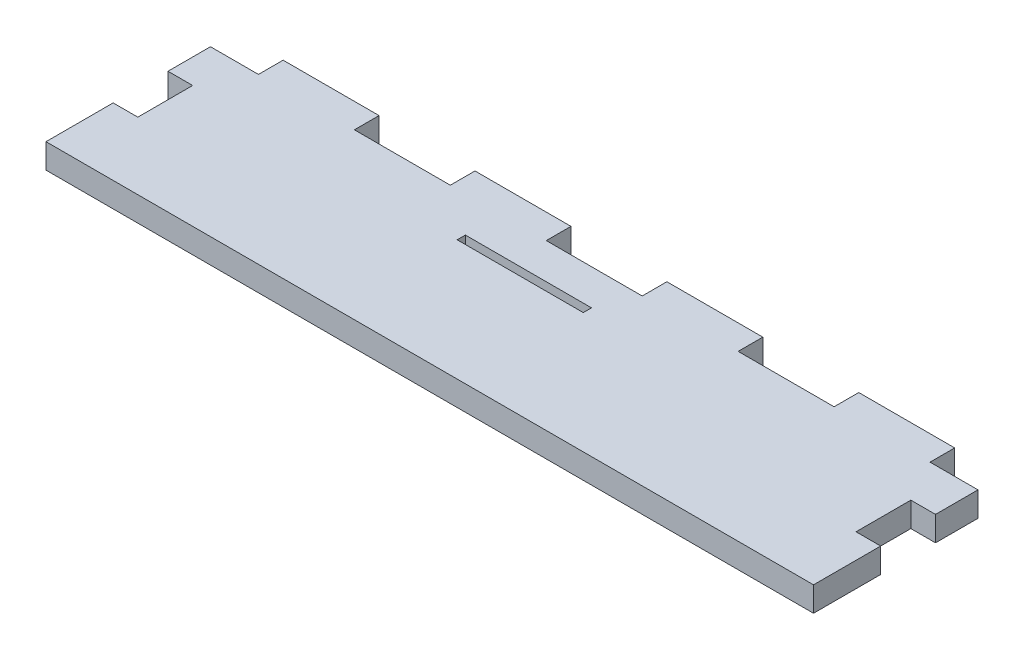
ISO-10303-21;
HEADER;
FILE_DESCRIPTION(('STEP AP214'),'2;1');
FILE_NAME('part.step','',(''),(''),'','','');
FILE_SCHEMA(('AUTOMOTIVE_DESIGN { 1 0 10303 214 1 1 1 1 }'));
ENDSEC;
DATA;
#1=APPLICATION_CONTEXT('core data for automotive mechanical design processes');
#2=APPLICATION_PROTOCOL_DEFINITION('international standard','automotive_design',2000,#1);
#3=PRODUCT_CONTEXT('',#1,'mechanical');
#4=PRODUCT('Part','Part','',(#3));
#5=PRODUCT_RELATED_PRODUCT_CATEGORY('part','',(#4));
#6=PRODUCT_DEFINITION_FORMATION('','',#4);
#7=PRODUCT_DEFINITION_CONTEXT('part definition',#1,'design');
#8=PRODUCT_DEFINITION('design','',#6,#7);
#9=PRODUCT_DEFINITION_SHAPE('','',#8);
#10=(LENGTH_UNIT() NAMED_UNIT(*) SI_UNIT(.MILLI.,.METRE.));
#11=(NAMED_UNIT(*) PLANE_ANGLE_UNIT() SI_UNIT($,.RADIAN.));
#12=(NAMED_UNIT(*) SI_UNIT($,.STERADIAN.) SOLID_ANGLE_UNIT());
#13=UNCERTAINTY_MEASURE_WITH_UNIT(LENGTH_MEASURE(1.E-05),#10,'distance_accuracy_value','');
#14=(GEOMETRIC_REPRESENTATION_CONTEXT(3) GLOBAL_UNCERTAINTY_ASSIGNED_CONTEXT((#13)) GLOBAL_UNIT_ASSIGNED_CONTEXT((#10,
#11,#12)) REPRESENTATION_CONTEXT('',''));
#15=CARTESIAN_POINT('',(0.,0.,0.));
#16=DIRECTION('',(0.,0.,1.));
#17=DIRECTION('',(1.,0.,0.));
#18=AXIS2_PLACEMENT_3D('',#15,#16,#17);
#19=CARTESIAN_POINT('',(140.,0.,349.144605516508));
#20=DIRECTION('',(-1.,0.,0.));
#21=DIRECTION('',(0.,0.,1.));
#22=AXIS2_PLACEMENT_3D('',#19,#20,#21);
#23=PLANE('',#22);
#24=DIRECTION('',(0.,0.,-1.));
#25=VECTOR('',#24,1.);
#26=CARTESIAN_POINT('',(140.,75.,349.144605516508));
#27=LINE('',#26,#25);
#28=CARTESIAN_POINT('',(140.,75.,69.));
#29=VERTEX_POINT('',#28);
#30=CARTESIAN_POINT('',(140.,75.,44.5));
#31=VERTEX_POINT('',#30);
#32=EDGE_CURVE('E449',#29,#31,#27,.T.);
#33=ORIENTED_EDGE('',*,*,#32,.F.);
#34=DIRECTION('',(0.,1.,0.));
#35=VECTOR('',#34,1.);
#36=CARTESIAN_POINT('',(140.,0.,69.));
#37=LINE('',#36,#35);
#38=CARTESIAN_POINT('',(140.,66.,69.));
#39=VERTEX_POINT('',#38);
#40=EDGE_CURVE('E424',#39,#29,#37,.T.);
#41=ORIENTED_EDGE('',*,*,#40,.F.);
#42=DIRECTION('',(0.,0.,-1.));
#43=VECTOR('',#42,1.);
#44=CARTESIAN_POINT('',(140.,66.,349.144605516508));
#45=LINE('',#44,#43);
#46=CARTESIAN_POINT('',(140.,66.,44.5));
#47=VERTEX_POINT('',#46);
#48=EDGE_CURVE('E445',#39,#47,#45,.T.);
#49=ORIENTED_EDGE('',*,*,#48,.T.);
#50=DIRECTION('',(0.,1.,0.));
#51=VECTOR('',#50,1.);
#52=CARTESIAN_POINT('',(140.,-95.,44.5));
#53=LINE('',#52,#51);
#54=EDGE_CURVE('E302',#47,#31,#53,.T.);
#55=ORIENTED_EDGE('',*,*,#54,.T.);
#56=EDGE_LOOP('',(#33,#41,#49,#55));
#57=FACE_BOUND('',#56,.T.);
#58=ADVANCED_FACE('F35',(#57),#23,.F.);
#59=CARTESIAN_POINT('',(-140.,0.,349.144605516508));
#60=DIRECTION('',(-1.,0.,0.));
#61=DIRECTION('',(0.,0.,1.));
#62=AXIS2_PLACEMENT_3D('',#59,#60,#61);
#63=PLANE('',#62);
#64=DIRECTION('',(0.,1.,0.));
#65=VECTOR('',#64,1.);
#66=CARTESIAN_POINT('',(-140.,-95.,24.5));
#67=LINE('',#66,#65);
#68=CARTESIAN_POINT('',(-140.,66.,24.5));
#69=VERTEX_POINT('',#68);
#70=CARTESIAN_POINT('',(-140.,75.,24.5));
#71=VERTEX_POINT('',#70);
#72=EDGE_CURVE('E287',#69,#71,#67,.T.);
#73=ORIENTED_EDGE('',*,*,#72,.T.);
#74=DIRECTION('',(0.,0.,-1.));
#75=VECTOR('',#74,1.);
#76=CARTESIAN_POINT('',(-140.,75.,349.144605516508));
#77=LINE('',#76,#75);
#78=CARTESIAN_POINT('',(-140.,75.,9.));
#79=VERTEX_POINT('',#78);
#80=EDGE_CURVE('E452',#71,#79,#77,.T.);
#81=ORIENTED_EDGE('',*,*,#80,.T.);
#82=DIRECTION('',(0.,-1.,0.));
#83=VECTOR('',#82,1.);
#84=CARTESIAN_POINT('',(-140.,0.,9.));
#85=LINE('',#84,#83);
#86=CARTESIAN_POINT('',(-140.,66.,9.));
#87=VERTEX_POINT('',#86);
#88=EDGE_CURVE('E432',#79,#87,#85,.T.);
#89=ORIENTED_EDGE('',*,*,#88,.T.);
#90=DIRECTION('',(0.,0.,-1.));
#91=VECTOR('',#90,1.);
#92=CARTESIAN_POINT('',(-140.,66.,349.144605516508));
#93=LINE('',#92,#91);
#94=EDGE_CURVE('E456',#69,#87,#93,.T.);
#95=ORIENTED_EDGE('',*,*,#94,.F.);
#96=EDGE_LOOP('',(#73,#81,#89,#95));
#97=FACE_BOUND('',#96,.T.);
#98=ADVANCED_FACE('F500',(#97),#63,.T.);
#99=CARTESIAN_POINT('',(0.,0.,9.));
#100=DIRECTION('',(0.,0.,-1.));
#101=DIRECTION('',(-1.,0.,0.));
#102=AXIS2_PLACEMENT_3D('',#99,#100,#101);
#103=PLANE('',#102);
#104=DIRECTION('',(0.,1.,0.));
#105=VECTOR('',#104,1.);
#106=CARTESIAN_POINT('',(87.5,0.,9.));
#107=LINE('',#106,#105);
#108=CARTESIAN_POINT('',(87.5,66.,9.));
#109=VERTEX_POINT('',#108);
#110=CARTESIAN_POINT('',(87.5,75.,9.));
#111=VERTEX_POINT('',#110);
#112=EDGE_CURVE('E312',#109,#111,#107,.T.);
#113=ORIENTED_EDGE('',*,*,#112,.F.);
#114=DIRECTION('',(-1.,0.,0.));
#115=VECTOR('',#114,1.);
#116=CARTESIAN_POINT('',(0.,66.,9.));
#117=LINE('',#116,#115);
#118=CARTESIAN_POINT('',(52.5,66.,9.));
#119=VERTEX_POINT('',#118);
#120=EDGE_CURVE('E433',#109,#119,#117,.T.);
#121=ORIENTED_EDGE('',*,*,#120,.T.);
#122=DIRECTION('',(0.,-1.,0.));
#123=VECTOR('',#122,1.);
#124=CARTESIAN_POINT('',(52.5,0.,9.));
#125=LINE('',#124,#123);
#126=CARTESIAN_POINT('',(52.5,75.,9.));
#127=VERTEX_POINT('',#126);
#128=EDGE_CURVE('E337',#127,#119,#125,.T.);
#129=ORIENTED_EDGE('',*,*,#128,.F.);
#130=DIRECTION('',(-1.,0.,0.));
#131=VECTOR('',#130,1.);
#132=CARTESIAN_POINT('',(0.,75.,9.));
#133=LINE('',#132,#131);
#134=EDGE_CURVE('E441',#111,#127,#133,.T.);
#135=ORIENTED_EDGE('',*,*,#134,.F.);
#136=EDGE_LOOP('',(#113,#121,#129,#135));
#137=FACE_BOUND('',#136,.T.);
#138=ADVANCED_FACE('F507',(#137),#103,.T.);
#139=DIRECTION('',(0.,1.,0.));
#140=VECTOR('',#139,1.);
#141=CARTESIAN_POINT('',(17.5,0.,9.));
#142=LINE('',#141,#140);
#143=CARTESIAN_POINT('',(17.5,66.,9.));
#144=VERTEX_POINT('',#143);
#145=CARTESIAN_POINT('',(17.5,75.,9.));
#146=VERTEX_POINT('',#145);
#147=EDGE_CURVE('E340',#144,#146,#142,.T.);
#148=ORIENTED_EDGE('',*,*,#147,.F.);
#149=CARTESIAN_POINT('',(-17.5,66.,9.));
#150=VERTEX_POINT('',#149);
#151=EDGE_CURVE('E585',#144,#150,#117,.T.);
#152=ORIENTED_EDGE('',*,*,#151,.T.);
#153=DIRECTION('',(0.,1.,0.));
#154=VECTOR('',#153,1.);
#155=CARTESIAN_POINT('',(-17.5,0.,9.));
#156=LINE('',#155,#154);
#157=CARTESIAN_POINT('',(-17.5,75.,9.));
#158=VERTEX_POINT('',#157);
#159=EDGE_CURVE('E365',#150,#158,#156,.T.);
#160=ORIENTED_EDGE('',*,*,#159,.T.);
#161=EDGE_CURVE('E601',#146,#158,#133,.T.);
#162=ORIENTED_EDGE('',*,*,#161,.F.);
#163=EDGE_LOOP('',(#148,#152,#160,#162));
#164=FACE_BOUND('',#163,.T.);
#165=ADVANCED_FACE('F614',(#164),#103,.T.);
#166=CARTESIAN_POINT('',(-52.5,66.,9.));
#167=VERTEX_POINT('',#166);
#168=CARTESIAN_POINT('',(-87.5,66.,9.));
#169=VERTEX_POINT('',#168);
#170=EDGE_CURVE('E566',#167,#169,#117,.T.);
#171=ORIENTED_EDGE('',*,*,#170,.T.);
#172=DIRECTION('',(0.,1.,0.));
#173=VECTOR('',#172,1.);
#174=CARTESIAN_POINT('',(-87.5,0.,9.));
#175=LINE('',#174,#173);
#176=CARTESIAN_POINT('',(-87.5,75.,9.));
#177=VERTEX_POINT('',#176);
#178=EDGE_CURVE('E393',#169,#177,#175,.T.);
#179=ORIENTED_EDGE('',*,*,#178,.T.);
#180=CARTESIAN_POINT('',(-52.5,75.,9.));
#181=VERTEX_POINT('',#180);
#182=EDGE_CURVE('E603',#181,#177,#133,.T.);
#183=ORIENTED_EDGE('',*,*,#182,.F.);
#184=DIRECTION('',(0.,-1.,0.));
#185=VECTOR('',#184,1.);
#186=CARTESIAN_POINT('',(-52.5,0.,9.));
#187=LINE('',#186,#185);
#188=EDGE_CURVE('E369',#181,#167,#187,.T.);
#189=ORIENTED_EDGE('',*,*,#188,.T.);
#190=EDGE_LOOP('',(#171,#179,#183,#189));
#191=FACE_BOUND('',#190,.T.);
#192=ADVANCED_FACE('F583',(#191),#103,.T.);
#193=DIRECTION('',(0.,-1.,0.));
#194=VECTOR('',#193,1.);
#195=CARTESIAN_POINT('',(122.5,-1.88892111828586E-13,9.));
#196=LINE('',#195,#194);
#197=CARTESIAN_POINT('',(122.5,75.,9.));
#198=VERTEX_POINT('',#197);
#199=CARTESIAN_POINT('',(122.5,66.,9.));
#200=VERTEX_POINT('',#199);
#201=EDGE_CURVE('E309',#198,#200,#196,.T.);
#202=ORIENTED_EDGE('',*,*,#201,.F.);
#203=CARTESIAN_POINT('',(140.,75.,9.));
#204=VERTEX_POINT('',#203);
#205=EDGE_CURVE('E437',#204,#198,#133,.T.);
#206=ORIENTED_EDGE('',*,*,#205,.F.);
#207=DIRECTION('',(0.,-1.,0.));
#208=VECTOR('',#207,1.);
#209=CARTESIAN_POINT('',(140.,0.,9.));
#210=LINE('',#209,#208);
#211=CARTESIAN_POINT('',(140.,66.,9.));
#212=VERTEX_POINT('',#211);
#213=EDGE_CURVE('E440',#204,#212,#210,.T.);
#214=ORIENTED_EDGE('',*,*,#213,.T.);
#215=EDGE_CURVE('E429',#212,#200,#117,.T.);
#216=ORIENTED_EDGE('',*,*,#215,.T.);
#217=EDGE_LOOP('',(#202,#206,#214,#216));
#218=FACE_BOUND('',#217,.T.);
#219=ADVANCED_FACE('F520',(#218),#103,.T.);
#220=DIRECTION('',(0.,-1.,0.));
#221=VECTOR('',#220,1.);
#222=CARTESIAN_POINT('',(-122.5,0.,9.));
#223=LINE('',#222,#221);
#224=CARTESIAN_POINT('',(-122.5,75.,9.));
#225=VERTEX_POINT('',#224);
#226=CARTESIAN_POINT('',(-122.5,66.,9.));
#227=VERTEX_POINT('',#226);
#228=EDGE_CURVE('E397',#225,#227,#223,.T.);
#229=ORIENTED_EDGE('',*,*,#228,.T.);
#230=EDGE_CURVE('E396',#227,#87,#117,.T.);
#231=ORIENTED_EDGE('',*,*,#230,.T.);
#232=ORIENTED_EDGE('',*,*,#88,.F.);
#233=EDGE_CURVE('E436',#225,#79,#133,.T.);
#234=ORIENTED_EDGE('',*,*,#233,.F.);
#235=EDGE_LOOP('',(#229,#231,#232,#234));
#236=FACE_BOUND('',#235,.T.);
#237=ADVANCED_FACE('F514',(#236),#103,.T.);
#238=CARTESIAN_POINT('',(140.,66.,24.5));
#239=VERTEX_POINT('',#238);
#240=EDGE_CURVE('E444',#239,#212,#45,.T.);
#241=ORIENTED_EDGE('',*,*,#240,.T.);
#242=ORIENTED_EDGE('',*,*,#213,.F.);
#243=CARTESIAN_POINT('',(140.,75.,24.5));
#244=VERTEX_POINT('',#243);
#245=EDGE_CURVE('E448',#244,#204,#27,.T.);
#246=ORIENTED_EDGE('',*,*,#245,.F.);
#247=DIRECTION('',(0.,1.,0.));
#248=VECTOR('',#247,1.);
#249=CARTESIAN_POINT('',(140.,-95.,24.5));
#250=LINE('',#249,#248);
#251=EDGE_CURVE('E305',#239,#244,#250,.T.);
#252=ORIENTED_EDGE('',*,*,#251,.F.);
#253=EDGE_LOOP('',(#241,#242,#246,#252));
#254=FACE_BOUND('',#253,.T.);
#255=ADVANCED_FACE('F503',(#254),#23,.F.);
#256=CARTESIAN_POINT('',(0.,75.,349.144605516508));
#257=DIRECTION('',(0.,1.,0.));
#258=DIRECTION('',(0.,0.,-1.));
#259=AXIS2_PLACEMENT_3D('',#256,#257,#258);
#260=PLANE('',#259);
#261=DIRECTION('',(0.,0.,1.));
#262=VECTOR('',#261,1.);
#263=CARTESIAN_POINT('',(-34.,75.,25.));
#264=LINE('',#263,#262);
#265=CARTESIAN_POINT('',(-34.,75.,22.));
#266=VERTEX_POINT('',#265);
#267=CARTESIAN_POINT('',(-34.,75.,25.));
#268=VERTEX_POINT('',#267);
#269=EDGE_CURVE('E50',#266,#268,#264,.T.);
#270=ORIENTED_EDGE('',*,*,#269,.F.);
#271=DIRECTION('',(-1.,0.,0.));
#272=VECTOR('',#271,1.);
#273=CARTESIAN_POINT('',(-34.,75.,22.));
#274=LINE('',#273,#272);
#275=CARTESIAN_POINT('',(12.,75.,22.));
#276=VERTEX_POINT('',#275);
#277=EDGE_CURVE('E263',#276,#266,#274,.T.);
#278=ORIENTED_EDGE('',*,*,#277,.F.);
#279=DIRECTION('',(0.,0.,-1.));
#280=VECTOR('',#279,1.);
#281=CARTESIAN_POINT('',(12.,75.,25.));
#282=LINE('',#281,#280);
#283=CARTESIAN_POINT('',(12.,75.,25.));
#284=VERTEX_POINT('',#283);
#285=EDGE_CURVE('E247',#284,#276,#282,.T.);
#286=ORIENTED_EDGE('',*,*,#285,.F.);
#287=DIRECTION('',(1.,0.,0.));
#288=VECTOR('',#287,1.);
#289=CARTESIAN_POINT('',(-34.,75.,25.));
#290=LINE('',#289,#288);
#291=EDGE_CURVE('E256',#268,#284,#290,.T.);
#292=ORIENTED_EDGE('',*,*,#291,.F.);
#293=EDGE_LOOP('',(#270,#278,#286,#292));
#294=FACE_BOUND('',#293,.T.);
#295=DIRECTION('',(1.,0.,0.));
#296=VECTOR('',#295,1.);
#297=CARTESIAN_POINT('',(-131.,75.,24.5));
#298=LINE('',#297,#296);
#299=CARTESIAN_POINT('',(-131.,75.,24.5));
#300=VERTEX_POINT('',#299);
#301=EDGE_CURVE('E280',#71,#300,#298,.T.);
#302=ORIENTED_EDGE('',*,*,#301,.T.);
#303=DIRECTION('',(0.,0.,1.));
#304=VECTOR('',#303,1.);
#305=CARTESIAN_POINT('',(-131.,75.,44.5));
#306=LINE('',#305,#304);
#307=CARTESIAN_POINT('',(-131.,75.,44.5));
#308=VERTEX_POINT('',#307);
#309=EDGE_CURVE('E273',#300,#308,#306,.T.);
#310=ORIENTED_EDGE('',*,*,#309,.T.);
#311=DIRECTION('',(-1.,0.,0.));
#312=VECTOR('',#311,1.);
#313=CARTESIAN_POINT('',(-131.,75.,44.5));
#314=LINE('',#313,#312);
#315=CARTESIAN_POINT('',(-140.,75.,44.5));
#316=VERTEX_POINT('',#315);
#317=EDGE_CURVE('E276',#308,#316,#314,.T.);
#318=ORIENTED_EDGE('',*,*,#317,.T.);
#319=CARTESIAN_POINT('',(-140.,75.,69.));
#320=VERTEX_POINT('',#319);
#321=EDGE_CURVE('E453',#320,#316,#77,.T.);
#322=ORIENTED_EDGE('',*,*,#321,.F.);
#323=DIRECTION('',(1.,0.,0.));
#324=VECTOR('',#323,1.);
#325=CARTESIAN_POINT('',(0.,75.,69.));
#326=LINE('',#325,#324);
#327=EDGE_CURVE('E421',#320,#29,#326,.T.);
#328=ORIENTED_EDGE('',*,*,#327,.T.);
#329=ORIENTED_EDGE('',*,*,#32,.T.);
#330=DIRECTION('',(-1.,0.,0.));
#331=VECTOR('',#330,1.);
#332=CARTESIAN_POINT('',(131.,75.,44.5));
#333=LINE('',#332,#331);
#334=CARTESIAN_POINT('',(131.,75.,44.5));
#335=VERTEX_POINT('',#334);
#336=EDGE_CURVE('E297',#31,#335,#333,.T.);
#337=ORIENTED_EDGE('',*,*,#336,.T.);
#338=DIRECTION('',(0.,0.,-1.));
#339=VECTOR('',#338,1.);
#340=CARTESIAN_POINT('',(131.,75.,44.5));
#341=LINE('',#340,#339);
#342=CARTESIAN_POINT('',(131.,75.,24.5));
#343=VERTEX_POINT('',#342);
#344=EDGE_CURVE('E270',#335,#343,#341,.T.);
#345=ORIENTED_EDGE('',*,*,#344,.T.);
#346=DIRECTION('',(1.,0.,0.));
#347=VECTOR('',#346,1.);
#348=CARTESIAN_POINT('',(131.,75.,24.5));
#349=LINE('',#348,#347);
#350=EDGE_CURVE('E295',#343,#244,#349,.T.);
#351=ORIENTED_EDGE('',*,*,#350,.T.);
#352=ORIENTED_EDGE('',*,*,#245,.T.);
#353=ORIENTED_EDGE('',*,*,#205,.T.);
#354=DIRECTION('',(0.,0.,-1.));
#355=VECTOR('',#354,1.);
#356=CARTESIAN_POINT('',(122.5,75.,45.1386219991853));
#357=LINE('',#356,#355);
#358=CARTESIAN_POINT('',(122.5,75.,0.));
#359=VERTEX_POINT('',#358);
#360=EDGE_CURVE('E332',#198,#359,#357,.T.);
#361=ORIENTED_EDGE('',*,*,#360,.T.);
#362=DIRECTION('',(1.,0.,0.));
#363=VECTOR('',#362,1.);
#364=CARTESIAN_POINT('',(0.,75.,0.));
#365=LINE('',#364,#363);
#366=CARTESIAN_POINT('',(87.5,75.,0.));
#367=VERTEX_POINT('',#366);
#368=EDGE_CURVE('E318',#367,#359,#365,.T.);
#369=ORIENTED_EDGE('',*,*,#368,.F.);
#370=DIRECTION('',(0.,0.,-1.));
#371=VECTOR('',#370,1.);
#372=CARTESIAN_POINT('',(87.5,75.,45.1386219991853));
#373=LINE('',#372,#371);
#374=EDGE_CURVE('E313',#111,#367,#373,.T.);
#375=ORIENTED_EDGE('',*,*,#374,.F.);
#376=ORIENTED_EDGE('',*,*,#134,.T.);
#377=DIRECTION('',(0.,0.,-1.));
#378=VECTOR('',#377,1.);
#379=CARTESIAN_POINT('',(52.5,75.,45.1386219991853));
#380=LINE('',#379,#378);
#381=CARTESIAN_POINT('',(52.5,75.,0.));
#382=VERTEX_POINT('',#381);
#383=EDGE_CURVE('E360',#127,#382,#380,.T.);
#384=ORIENTED_EDGE('',*,*,#383,.T.);
#385=DIRECTION('',(1.,0.,0.));
#386=VECTOR('',#385,1.);
#387=CARTESIAN_POINT('',(0.,75.,0.));
#388=LINE('',#387,#386);
#389=CARTESIAN_POINT('',(17.5,75.,0.));
#390=VERTEX_POINT('',#389);
#391=EDGE_CURVE('E346',#390,#382,#388,.T.);
#392=ORIENTED_EDGE('',*,*,#391,.F.);
#393=DIRECTION('',(0.,0.,-1.));
#394=VECTOR('',#393,1.);
#395=CARTESIAN_POINT('',(17.5,75.,45.1386219991853));
#396=LINE('',#395,#394);
#397=EDGE_CURVE('E341',#146,#390,#396,.T.);
#398=ORIENTED_EDGE('',*,*,#397,.F.);
#399=ORIENTED_EDGE('',*,*,#161,.T.);
#400=DIRECTION('',(0.,0.,-1.));
#401=VECTOR('',#400,1.);
#402=CARTESIAN_POINT('',(-17.5,75.,45.1386219991853));
#403=LINE('',#402,#401);
#404=CARTESIAN_POINT('',(-17.5,75.,0.));
#405=VERTEX_POINT('',#404);
#406=EDGE_CURVE('E388',#158,#405,#403,.T.);
#407=ORIENTED_EDGE('',*,*,#406,.T.);
#408=DIRECTION('',(1.,0.,0.));
#409=VECTOR('',#408,1.);
#410=CARTESIAN_POINT('',(0.,75.,0.));
#411=LINE('',#410,#409);
#412=CARTESIAN_POINT('',(-52.5,75.,0.));
#413=VERTEX_POINT('',#412);
#414=EDGE_CURVE('E344',#413,#405,#411,.T.);
#415=ORIENTED_EDGE('',*,*,#414,.F.);
#416=DIRECTION('',(0.,0.,-1.));
#417=VECTOR('',#416,1.);
#418=CARTESIAN_POINT('',(-52.5,75.,45.1386219991853));
#419=LINE('',#418,#417);
#420=EDGE_CURVE('E379',#181,#413,#419,.T.);
#421=ORIENTED_EDGE('',*,*,#420,.F.);
#422=ORIENTED_EDGE('',*,*,#182,.T.);
#423=DIRECTION('',(0.,0.,-1.));
#424=VECTOR('',#423,1.);
#425=CARTESIAN_POINT('',(-87.5,75.,45.1386219991853));
#426=LINE('',#425,#424);
#427=CARTESIAN_POINT('',(-87.5,75.,0.));
#428=VERTEX_POINT('',#427);
#429=EDGE_CURVE('E416',#177,#428,#426,.T.);
#430=ORIENTED_EDGE('',*,*,#429,.T.);
#431=DIRECTION('',(1.,0.,0.));
#432=VECTOR('',#431,1.);
#433=CARTESIAN_POINT('',(0.,75.,0.));
#434=LINE('',#433,#432);
#435=CARTESIAN_POINT('',(-122.5,75.,0.));
#436=VERTEX_POINT('',#435);
#437=EDGE_CURVE('E368',#436,#428,#434,.T.);
#438=ORIENTED_EDGE('',*,*,#437,.F.);
#439=DIRECTION('',(0.,0.,-1.));
#440=VECTOR('',#439,1.);
#441=CARTESIAN_POINT('',(-122.5,75.,45.1386219991853));
#442=LINE('',#441,#440);
#443=EDGE_CURVE('E407',#225,#436,#442,.T.);
#444=ORIENTED_EDGE('',*,*,#443,.F.);
#445=ORIENTED_EDGE('',*,*,#233,.T.);
#446=ORIENTED_EDGE('',*,*,#80,.F.);
#447=EDGE_LOOP('',(#302,#310,#318,#322,#328,#329,#337,#345,#351,#352,#353,#361,#369,#375,#376,
#384,#392,#398,#399,#407,#415,#421,#422,#430,#438,#444,#445,#446));
#448=FACE_BOUND('',#447,.T.);
#449=ADVANCED_FACE('F260',(#294,#448),#260,.T.);
#450=DIRECTION('',(0.,1.,0.));
#451=VECTOR('',#450,1.);
#452=CARTESIAN_POINT('',(-140.,-95.,44.5));
#453=LINE('',#452,#451);
#454=CARTESIAN_POINT('',(-140.,66.,44.5));
#455=VERTEX_POINT('',#454);
#456=EDGE_CURVE('E290',#455,#316,#453,.T.);
#457=ORIENTED_EDGE('',*,*,#456,.F.);
#458=CARTESIAN_POINT('',(-140.,66.,69.));
#459=VERTEX_POINT('',#458);
#460=EDGE_CURVE('E457',#459,#455,#93,.T.);
#461=ORIENTED_EDGE('',*,*,#460,.F.);
#462=DIRECTION('',(0.,1.,0.));
#463=VECTOR('',#462,1.);
#464=CARTESIAN_POINT('',(-140.,0.,69.));
#465=LINE('',#464,#463);
#466=EDGE_CURVE('E423',#459,#320,#465,.T.);
#467=ORIENTED_EDGE('',*,*,#466,.T.);
#468=ORIENTED_EDGE('',*,*,#321,.T.);
#469=EDGE_LOOP('',(#457,#461,#467,#468));
#470=FACE_BOUND('',#469,.T.);
#471=ADVANCED_FACE('F509',(#470),#63,.T.);
#472=CARTESIAN_POINT('',(0.,66.,349.144605516508));
#473=DIRECTION('',(0.,1.,0.));
#474=DIRECTION('',(0.,0.,-1.));
#475=AXIS2_PLACEMENT_3D('',#472,#473,#474);
#476=PLANE('',#475);
#477=DIRECTION('',(-1.,0.,0.));
#478=VECTOR('',#477,1.);
#479=CARTESIAN_POINT('',(0.,66.,22.));
#480=LINE('',#479,#478);
#481=CARTESIAN_POINT('',(12.,66.,22.));
#482=VERTEX_POINT('',#481);
#483=CARTESIAN_POINT('',(-34.,66.,22.));
#484=VERTEX_POINT('',#483);
#485=EDGE_CURVE('E43',#482,#484,#480,.T.);
#486=ORIENTED_EDGE('',*,*,#485,.T.);
#487=DIRECTION('',(0.,0.,1.));
#488=VECTOR('',#487,1.);
#489=CARTESIAN_POINT('',(-34.,66.,349.144605516508));
#490=LINE('',#489,#488);
#491=CARTESIAN_POINT('',(-34.,66.,25.));
#492=VERTEX_POINT('',#491);
#493=EDGE_CURVE('E11',#484,#492,#490,.T.);
#494=ORIENTED_EDGE('',*,*,#493,.T.);
#495=DIRECTION('',(1.,0.,0.));
#496=VECTOR('',#495,1.);
#497=CARTESIAN_POINT('',(0.,66.,25.));
#498=LINE('',#497,#496);
#499=CARTESIAN_POINT('',(12.,66.,25.));
#500=VERTEX_POINT('',#499);
#501=EDGE_CURVE('E477',#492,#500,#498,.T.);
#502=ORIENTED_EDGE('',*,*,#501,.T.);
#503=DIRECTION('',(0.,0.,-1.));
#504=VECTOR('',#503,1.);
#505=CARTESIAN_POINT('',(12.,66.,349.144605516508));
#506=LINE('',#505,#504);
#507=EDGE_CURVE('E250',#500,#482,#506,.T.);
#508=ORIENTED_EDGE('',*,*,#507,.T.);
#509=EDGE_LOOP('',(#486,#494,#502,#508));
#510=FACE_BOUND('',#509,.T.);
#511=ORIENTED_EDGE('',*,*,#94,.T.);
#512=ORIENTED_EDGE('',*,*,#230,.F.);
#513=DIRECTION('',(0.,0.,-1.));
#514=VECTOR('',#513,1.);
#515=CARTESIAN_POINT('',(-122.5,66.,45.1386219991853));
#516=LINE('',#515,#514);
#517=CARTESIAN_POINT('',(-122.5,66.,0.));
#518=VERTEX_POINT('',#517);
#519=EDGE_CURVE('E410',#227,#518,#516,.T.);
#520=ORIENTED_EDGE('',*,*,#519,.T.);
#521=DIRECTION('',(1.,0.,0.));
#522=VECTOR('',#521,1.);
#523=CARTESIAN_POINT('',(0.,66.,0.));
#524=LINE('',#523,#522);
#525=CARTESIAN_POINT('',(-87.5,66.,0.));
#526=VERTEX_POINT('',#525);
#527=EDGE_CURVE('E402',#518,#526,#524,.T.);
#528=ORIENTED_EDGE('',*,*,#527,.T.);
#529=DIRECTION('',(0.,0.,-1.));
#530=VECTOR('',#529,1.);
#531=CARTESIAN_POINT('',(-87.5,66.,45.1386219991853));
#532=LINE('',#531,#530);
#533=EDGE_CURVE('E413',#169,#526,#532,.T.);
#534=ORIENTED_EDGE('',*,*,#533,.F.);
#535=ORIENTED_EDGE('',*,*,#170,.F.);
#536=DIRECTION('',(0.,0.,-1.));
#537=VECTOR('',#536,1.);
#538=CARTESIAN_POINT('',(-52.5,66.,45.1386219991853));
#539=LINE('',#538,#537);
#540=CARTESIAN_POINT('',(-52.5,66.,0.));
#541=VERTEX_POINT('',#540);
#542=EDGE_CURVE('E382',#167,#541,#539,.T.);
#543=ORIENTED_EDGE('',*,*,#542,.T.);
#544=DIRECTION('',(1.,0.,0.));
#545=VECTOR('',#544,1.);
#546=CARTESIAN_POINT('',(0.,66.,0.));
#547=LINE('',#546,#545);
#548=CARTESIAN_POINT('',(-17.5,66.,0.));
#549=VERTEX_POINT('',#548);
#550=EDGE_CURVE('E374',#541,#549,#547,.T.);
#551=ORIENTED_EDGE('',*,*,#550,.T.);
#552=DIRECTION('',(0.,0.,-1.));
#553=VECTOR('',#552,1.);
#554=CARTESIAN_POINT('',(-17.5,66.,45.1386219991853));
#555=LINE('',#554,#553);
#556=EDGE_CURVE('E385',#150,#549,#555,.T.);
#557=ORIENTED_EDGE('',*,*,#556,.F.);
#558=ORIENTED_EDGE('',*,*,#151,.F.);
#559=DIRECTION('',(0.,0.,-1.));
#560=VECTOR('',#559,1.);
#561=CARTESIAN_POINT('',(17.5,66.,45.1386219991853));
#562=LINE('',#561,#560);
#563=CARTESIAN_POINT('',(17.5,66.,0.));
#564=VERTEX_POINT('',#563);
#565=EDGE_CURVE('E354',#144,#564,#562,.T.);
#566=ORIENTED_EDGE('',*,*,#565,.T.);
#567=DIRECTION('',(1.,0.,0.));
#568=VECTOR('',#567,1.);
#569=CARTESIAN_POINT('',(0.,66.,0.));
#570=LINE('',#569,#568);
#571=CARTESIAN_POINT('',(52.5,66.,0.));
#572=VERTEX_POINT('',#571);
#573=EDGE_CURVE('E351',#564,#572,#570,.T.);
#574=ORIENTED_EDGE('',*,*,#573,.T.);
#575=DIRECTION('',(0.,0.,-1.));
#576=VECTOR('',#575,1.);
#577=CARTESIAN_POINT('',(52.5,66.,45.1386219991853));
#578=LINE('',#577,#576);
#579=EDGE_CURVE('E357',#119,#572,#578,.T.);
#580=ORIENTED_EDGE('',*,*,#579,.F.);
#581=ORIENTED_EDGE('',*,*,#120,.F.);
#582=DIRECTION('',(0.,0.,-1.));
#583=VECTOR('',#582,1.);
#584=CARTESIAN_POINT('',(87.5,66.,45.1386219991853));
#585=LINE('',#584,#583);
#586=CARTESIAN_POINT('',(87.5,66.,0.));
#587=VERTEX_POINT('',#586);
#588=EDGE_CURVE('E326',#109,#587,#585,.T.);
#589=ORIENTED_EDGE('',*,*,#588,.T.);
#590=DIRECTION('',(1.,0.,0.));
#591=VECTOR('',#590,1.);
#592=CARTESIAN_POINT('',(0.,66.,0.));
#593=LINE('',#592,#591);
#594=CARTESIAN_POINT('',(122.5,66.,0.));
#595=VERTEX_POINT('',#594);
#596=EDGE_CURVE('E323',#587,#595,#593,.T.);
#597=ORIENTED_EDGE('',*,*,#596,.T.);
#598=DIRECTION('',(0.,0.,-1.));
#599=VECTOR('',#598,1.);
#600=CARTESIAN_POINT('',(122.5,66.,45.1386219991853));
#601=LINE('',#600,#599);
#602=EDGE_CURVE('E329',#200,#595,#601,.T.);
#603=ORIENTED_EDGE('',*,*,#602,.F.);
#604=ORIENTED_EDGE('',*,*,#215,.F.);
#605=ORIENTED_EDGE('',*,*,#240,.F.);
#606=DIRECTION('',(1.,0.,0.));
#607=VECTOR('',#606,1.);
#608=CARTESIAN_POINT('',(0.,66.,24.5));
#609=LINE('',#608,#607);
#610=CARTESIAN_POINT('',(131.,66.,24.5));
#611=VERTEX_POINT('',#610);
#612=EDGE_CURVE('E428',#611,#239,#609,.T.);
#613=ORIENTED_EDGE('',*,*,#612,.F.);
#614=DIRECTION('',(0.,0.,-1.));
#615=VECTOR('',#614,1.);
#616=CARTESIAN_POINT('',(131.,66.,349.144605516508));
#617=LINE('',#616,#615);
#618=CARTESIAN_POINT('',(131.,66.,44.5));
#619=VERTEX_POINT('',#618);
#620=EDGE_CURVE('E463',#619,#611,#617,.T.);
#621=ORIENTED_EDGE('',*,*,#620,.F.);
#622=DIRECTION('',(-1.,0.,0.));
#623=VECTOR('',#622,1.);
#624=CARTESIAN_POINT('',(0.,66.,44.5));
#625=LINE('',#624,#623);
#626=EDGE_CURVE('E466',#47,#619,#625,.T.);
#627=ORIENTED_EDGE('',*,*,#626,.F.);
#628=ORIENTED_EDGE('',*,*,#48,.F.);
#629=DIRECTION('',(1.,0.,0.));
#630=VECTOR('',#629,1.);
#631=CARTESIAN_POINT('',(0.,66.,69.));
#632=LINE('',#631,#630);
#633=EDGE_CURVE('E426',#459,#39,#632,.T.);
#634=ORIENTED_EDGE('',*,*,#633,.F.);
#635=ORIENTED_EDGE('',*,*,#460,.T.);
#636=DIRECTION('',(-1.,0.,0.));
#637=VECTOR('',#636,1.);
#638=CARTESIAN_POINT('',(0.,66.,44.5));
#639=LINE('',#638,#637);
#640=CARTESIAN_POINT('',(-131.,66.,44.5));
#641=VERTEX_POINT('',#640);
#642=EDGE_CURVE('E469',#641,#455,#639,.T.);
#643=ORIENTED_EDGE('',*,*,#642,.F.);
#644=DIRECTION('',(0.,0.,1.));
#645=VECTOR('',#644,1.);
#646=CARTESIAN_POINT('',(-131.,66.,349.144605516508));
#647=LINE('',#646,#645);
#648=CARTESIAN_POINT('',(-131.,66.,24.5));
#649=VERTEX_POINT('',#648);
#650=EDGE_CURVE('E471',#649,#641,#647,.T.);
#651=ORIENTED_EDGE('',*,*,#650,.F.);
#652=DIRECTION('',(1.,0.,0.));
#653=VECTOR('',#652,1.);
#654=CARTESIAN_POINT('',(0.,66.,24.5));
#655=LINE('',#654,#653);
#656=EDGE_CURVE('E474',#69,#649,#655,.T.);
#657=ORIENTED_EDGE('',*,*,#656,.F.);
#658=EDGE_LOOP('',(#511,#512,#520,#528,#534,#535,#543,#551,#557,#558,#566,#574,#580,#581,#589,
#597,#603,#604,#605,#613,#621,#627,#628,#634,#635,#643,#651,#657));
#659=FACE_BOUND('',#658,.T.);
#660=ADVANCED_FACE('F37',(#510,#659),#476,.F.);
#661=CARTESIAN_POINT('',(0.,0.,69.));
#662=DIRECTION('',(0.,0.,-1.));
#663=DIRECTION('',(-1.,0.,0.));
#664=AXIS2_PLACEMENT_3D('',#661,#662,#663);
#665=PLANE('',#664);
#666=ORIENTED_EDGE('',*,*,#466,.F.);
#667=ORIENTED_EDGE('',*,*,#633,.T.);
#668=ORIENTED_EDGE('',*,*,#40,.T.);
#669=ORIENTED_EDGE('',*,*,#327,.F.);
#670=EDGE_LOOP('',(#666,#667,#668,#669));
#671=FACE_BOUND('',#670,.T.);
#672=ADVANCED_FACE('F551',(#671),#665,.F.);
#673=CARTESIAN_POINT('',(0.,0.,0.));
#674=DIRECTION('',(0.,0.,1.));
#675=DIRECTION('',(1.,0.,0.));
#676=AXIS2_PLACEMENT_3D('',#673,#674,#675);
#677=PLANE('',#676);
#678=ORIENTED_EDGE('',*,*,#437,.T.);
#679=DIRECTION('',(0.,-1.,0.));
#680=VECTOR('',#679,1.);
#681=CARTESIAN_POINT('',(-87.5,0.,0.));
#682=LINE('',#681,#680);
#683=EDGE_CURVE('E400',#428,#526,#682,.T.);
#684=ORIENTED_EDGE('',*,*,#683,.T.);
#685=ORIENTED_EDGE('',*,*,#527,.F.);
#686=DIRECTION('',(0.,1.,0.));
#687=VECTOR('',#686,1.);
#688=CARTESIAN_POINT('',(-122.5,0.,0.));
#689=LINE('',#688,#687);
#690=EDGE_CURVE('E405',#518,#436,#689,.T.);
#691=ORIENTED_EDGE('',*,*,#690,.T.);
#692=EDGE_LOOP('',(#678,#684,#685,#691));
#693=FACE_BOUND('',#692,.T.);
#694=ADVANCED_FACE('F574',(#693),#677,.F.);
#695=CARTESIAN_POINT('',(-122.5,0.,45.1386219991853));
#696=DIRECTION('',(1.,0.,0.));
#697=DIRECTION('',(0.,0.,-1.));
#698=AXIS2_PLACEMENT_3D('',#695,#696,#697);
#699=PLANE('',#698);
#700=ORIENTED_EDGE('',*,*,#443,.T.);
#701=ORIENTED_EDGE('',*,*,#690,.F.);
#702=ORIENTED_EDGE('',*,*,#519,.F.);
#703=ORIENTED_EDGE('',*,*,#228,.F.);
#704=EDGE_LOOP('',(#700,#701,#702,#703));
#705=FACE_BOUND('',#704,.T.);
#706=ADVANCED_FACE('F570',(#705),#699,.F.);
#707=CARTESIAN_POINT('',(-87.5,0.,45.1386219991853));
#708=DIRECTION('',(-1.,0.,0.));
#709=DIRECTION('',(0.,0.,1.));
#710=AXIS2_PLACEMENT_3D('',#707,#708,#709);
#711=PLANE('',#710);
#712=ORIENTED_EDGE('',*,*,#533,.T.);
#713=ORIENTED_EDGE('',*,*,#683,.F.);
#714=ORIENTED_EDGE('',*,*,#429,.F.);
#715=ORIENTED_EDGE('',*,*,#178,.F.);
#716=EDGE_LOOP('',(#712,#713,#714,#715));
#717=FACE_BOUND('',#716,.T.);
#718=ADVANCED_FACE('F579',(#717),#711,.F.);
#719=CARTESIAN_POINT('',(0.,0.,0.));
#720=DIRECTION('',(0.,0.,1.));
#721=DIRECTION('',(1.,0.,0.));
#722=AXIS2_PLACEMENT_3D('',#719,#720,#721);
#723=PLANE('',#722);
#724=ORIENTED_EDGE('',*,*,#414,.T.);
#725=DIRECTION('',(0.,-1.,0.));
#726=VECTOR('',#725,1.);
#727=CARTESIAN_POINT('',(-17.5,0.,0.));
#728=LINE('',#727,#726);
#729=EDGE_CURVE('E372',#405,#549,#728,.T.);
#730=ORIENTED_EDGE('',*,*,#729,.T.);
#731=ORIENTED_EDGE('',*,*,#550,.F.);
#732=DIRECTION('',(0.,1.,0.));
#733=VECTOR('',#732,1.);
#734=CARTESIAN_POINT('',(-52.5,0.,0.));
#735=LINE('',#734,#733);
#736=EDGE_CURVE('E377',#541,#413,#735,.T.);
#737=ORIENTED_EDGE('',*,*,#736,.T.);
#738=EDGE_LOOP('',(#724,#730,#731,#737));
#739=FACE_BOUND('',#738,.T.);
#740=ADVANCED_FACE('F611',(#739),#723,.F.);
#741=CARTESIAN_POINT('',(-52.5,0.,45.1386219991853));
#742=DIRECTION('',(1.,0.,0.));
#743=DIRECTION('',(0.,0.,-1.));
#744=AXIS2_PLACEMENT_3D('',#741,#742,#743);
#745=PLANE('',#744);
#746=ORIENTED_EDGE('',*,*,#420,.T.);
#747=ORIENTED_EDGE('',*,*,#736,.F.);
#748=ORIENTED_EDGE('',*,*,#542,.F.);
#749=ORIENTED_EDGE('',*,*,#188,.F.);
#750=EDGE_LOOP('',(#746,#747,#748,#749));
#751=FACE_BOUND('',#750,.T.);
#752=ADVANCED_FACE('F607',(#751),#745,.F.);
#753=CARTESIAN_POINT('',(-17.5,0.,45.1386219991853));
#754=DIRECTION('',(-1.,0.,0.));
#755=DIRECTION('',(0.,0.,1.));
#756=AXIS2_PLACEMENT_3D('',#753,#754,#755);
#757=PLANE('',#756);
#758=ORIENTED_EDGE('',*,*,#556,.T.);
#759=ORIENTED_EDGE('',*,*,#729,.F.);
#760=ORIENTED_EDGE('',*,*,#406,.F.);
#761=ORIENTED_EDGE('',*,*,#159,.F.);
#762=EDGE_LOOP('',(#758,#759,#760,#761));
#763=FACE_BOUND('',#762,.T.);
#764=ADVANCED_FACE('F613',(#763),#757,.F.);
#765=CARTESIAN_POINT('',(17.5,0.,45.1386219991853));
#766=DIRECTION('',(-1.,0.,0.));
#767=DIRECTION('',(0.,0.,1.));
#768=AXIS2_PLACEMENT_3D('',#765,#766,#767);
#769=PLANE('',#768);
#770=ORIENTED_EDGE('',*,*,#147,.T.);
#771=ORIENTED_EDGE('',*,*,#397,.T.);
#772=DIRECTION('',(0.,-1.,0.));
#773=VECTOR('',#772,1.);
#774=CARTESIAN_POINT('',(17.5,0.,0.));
#775=LINE('',#774,#773);
#776=EDGE_CURVE('E316',#390,#564,#775,.T.);
#777=ORIENTED_EDGE('',*,*,#776,.T.);
#778=ORIENTED_EDGE('',*,*,#565,.F.);
#779=EDGE_LOOP('',(#770,#771,#777,#778));
#780=FACE_BOUND('',#779,.T.);
#781=ADVANCED_FACE('F616',(#780),#769,.T.);
#782=CARTESIAN_POINT('',(52.5,0.,45.1386219991853));
#783=DIRECTION('',(1.,0.,0.));
#784=DIRECTION('',(0.,0.,-1.));
#785=AXIS2_PLACEMENT_3D('',#782,#783,#784);
#786=PLANE('',#785);
#787=ORIENTED_EDGE('',*,*,#128,.T.);
#788=ORIENTED_EDGE('',*,*,#579,.T.);
#789=DIRECTION('',(0.,1.,0.));
#790=VECTOR('',#789,1.);
#791=CARTESIAN_POINT('',(52.5,0.,0.));
#792=LINE('',#791,#790);
#793=EDGE_CURVE('E349',#572,#382,#792,.T.);
#794=ORIENTED_EDGE('',*,*,#793,.T.);
#795=ORIENTED_EDGE('',*,*,#383,.F.);
#796=EDGE_LOOP('',(#787,#788,#794,#795));
#797=FACE_BOUND('',#796,.T.);
#798=ADVANCED_FACE('F598',(#797),#786,.T.);
#799=CARTESIAN_POINT('',(0.,0.,0.));
#800=DIRECTION('',(0.,0.,1.));
#801=DIRECTION('',(1.,0.,0.));
#802=AXIS2_PLACEMENT_3D('',#799,#800,#801);
#803=PLANE('',#802);
#804=ORIENTED_EDGE('',*,*,#776,.F.);
#805=ORIENTED_EDGE('',*,*,#391,.T.);
#806=ORIENTED_EDGE('',*,*,#793,.F.);
#807=ORIENTED_EDGE('',*,*,#573,.F.);
#808=EDGE_LOOP('',(#804,#805,#806,#807));
#809=FACE_BOUND('',#808,.T.);
#810=ADVANCED_FACE('F618',(#809),#803,.F.);
#811=CARTESIAN_POINT('',(87.5,0.,45.1386219991853));
#812=DIRECTION('',(-1.,0.,0.));
#813=DIRECTION('',(0.,0.,1.));
#814=AXIS2_PLACEMENT_3D('',#811,#812,#813);
#815=PLANE('',#814);
#816=ORIENTED_EDGE('',*,*,#112,.T.);
#817=ORIENTED_EDGE('',*,*,#374,.T.);
#818=DIRECTION('',(0.,-1.,0.));
#819=VECTOR('',#818,1.);
#820=CARTESIAN_POINT('',(87.5,0.,0.));
#821=LINE('',#820,#819);
#822=EDGE_CURVE('E286',#367,#587,#821,.T.);
#823=ORIENTED_EDGE('',*,*,#822,.T.);
#824=ORIENTED_EDGE('',*,*,#588,.F.);
#825=EDGE_LOOP('',(#816,#817,#823,#824));
#826=FACE_BOUND('',#825,.T.);
#827=ADVANCED_FACE('F620',(#826),#815,.T.);
#828=CARTESIAN_POINT('',(122.5,-1.88892111828586E-13,45.1386219991853));
#829=DIRECTION('',(1.,0.,0.));
#830=DIRECTION('',(0.,-1.,0.));
#831=AXIS2_PLACEMENT_3D('',#828,#829,#830);
#832=PLANE('',#831);
#833=ORIENTED_EDGE('',*,*,#201,.T.);
#834=ORIENTED_EDGE('',*,*,#602,.T.);
#835=DIRECTION('',(0.,1.,0.));
#836=VECTOR('',#835,1.);
#837=CARTESIAN_POINT('',(122.5,-1.88892111828586E-13,0.));
#838=LINE('',#837,#836);
#839=EDGE_CURVE('E321',#595,#359,#838,.T.);
#840=ORIENTED_EDGE('',*,*,#839,.T.);
#841=ORIENTED_EDGE('',*,*,#360,.F.);
#842=EDGE_LOOP('',(#833,#834,#840,#841));
#843=FACE_BOUND('',#842,.T.);
#844=ADVANCED_FACE('F626',(#843),#832,.T.);
#845=CARTESIAN_POINT('',(0.,0.,0.));
#846=DIRECTION('',(0.,0.,1.));
#847=DIRECTION('',(1.,0.,0.));
#848=AXIS2_PLACEMENT_3D('',#845,#846,#847);
#849=PLANE('',#848);
#850=ORIENTED_EDGE('',*,*,#822,.F.);
#851=ORIENTED_EDGE('',*,*,#368,.T.);
#852=ORIENTED_EDGE('',*,*,#839,.F.);
#853=ORIENTED_EDGE('',*,*,#596,.F.);
#854=EDGE_LOOP('',(#850,#851,#852,#853));
#855=FACE_BOUND('',#854,.T.);
#856=ADVANCED_FACE('F792',(#855),#849,.F.);
#857=CARTESIAN_POINT('',(131.,-95.,44.5));
#858=DIRECTION('',(-1.,0.,0.));
#859=DIRECTION('',(0.,0.,1.));
#860=AXIS2_PLACEMENT_3D('',#857,#858,#859);
#861=PLANE('',#860);
#862=DIRECTION('',(0.,1.,0.));
#863=VECTOR('',#862,1.);
#864=CARTESIAN_POINT('',(131.,-95.,44.5));
#865=LINE('',#864,#863);
#866=EDGE_CURVE('E277',#619,#335,#865,.T.);
#867=ORIENTED_EDGE('',*,*,#866,.F.);
#868=ORIENTED_EDGE('',*,*,#620,.T.);
#869=DIRECTION('',(0.,1.,0.));
#870=VECTOR('',#869,1.);
#871=CARTESIAN_POINT('',(131.,-95.,24.5));
#872=LINE('',#871,#870);
#873=EDGE_CURVE('E300',#611,#343,#872,.T.);
#874=ORIENTED_EDGE('',*,*,#873,.T.);
#875=ORIENTED_EDGE('',*,*,#344,.F.);
#876=EDGE_LOOP('',(#867,#868,#874,#875));
#877=FACE_BOUND('',#876,.T.);
#878=ADVANCED_FACE('F541',(#877),#861,.F.);
#879=CARTESIAN_POINT('',(131.,-95.,44.5));
#880=DIRECTION('',(0.,0.,1.));
#881=DIRECTION('',(1.,0.,0.));
#882=AXIS2_PLACEMENT_3D('',#879,#880,#881);
#883=PLANE('',#882);
#884=ORIENTED_EDGE('',*,*,#54,.F.);
#885=ORIENTED_EDGE('',*,*,#626,.T.);
#886=ORIENTED_EDGE('',*,*,#866,.T.);
#887=ORIENTED_EDGE('',*,*,#336,.F.);
#888=EDGE_LOOP('',(#884,#885,#886,#887));
#889=FACE_BOUND('',#888,.T.);
#890=ADVANCED_FACE('F543',(#889),#883,.F.);
#891=CARTESIAN_POINT('',(131.,-95.,24.5));
#892=DIRECTION('',(0.,0.,-1.));
#893=DIRECTION('',(-1.,0.,0.));
#894=AXIS2_PLACEMENT_3D('',#891,#892,#893);
#895=PLANE('',#894);
#896=ORIENTED_EDGE('',*,*,#873,.F.);
#897=ORIENTED_EDGE('',*,*,#612,.T.);
#898=ORIENTED_EDGE('',*,*,#251,.T.);
#899=ORIENTED_EDGE('',*,*,#350,.F.);
#900=EDGE_LOOP('',(#896,#897,#898,#899));
#901=FACE_BOUND('',#900,.T.);
#902=ADVANCED_FACE('F536',(#901),#895,.F.);
#903=CARTESIAN_POINT('',(-131.,-95.,44.5));
#904=DIRECTION('',(1.,0.,0.));
#905=DIRECTION('',(0.,0.,-1.));
#906=AXIS2_PLACEMENT_3D('',#903,#904,#905);
#907=PLANE('',#906);
#908=DIRECTION('',(0.,1.,0.));
#909=VECTOR('',#908,1.);
#910=CARTESIAN_POINT('',(-131.,-95.,24.5));
#911=LINE('',#910,#909);
#912=EDGE_CURVE('E284',#649,#300,#911,.T.);
#913=ORIENTED_EDGE('',*,*,#912,.F.);
#914=ORIENTED_EDGE('',*,*,#650,.T.);
#915=DIRECTION('',(0.,1.,0.));
#916=VECTOR('',#915,1.);
#917=CARTESIAN_POINT('',(-131.,-95.,44.5));
#918=LINE('',#917,#916);
#919=EDGE_CURVE('E283',#641,#308,#918,.T.);
#920=ORIENTED_EDGE('',*,*,#919,.T.);
#921=ORIENTED_EDGE('',*,*,#309,.F.);
#922=EDGE_LOOP('',(#913,#914,#920,#921));
#923=FACE_BOUND('',#922,.T.);
#924=ADVANCED_FACE('F558',(#923),#907,.F.);
#925=CARTESIAN_POINT('',(-131.,-95.,24.5));
#926=DIRECTION('',(0.,0.,-1.));
#927=DIRECTION('',(-1.,0.,0.));
#928=AXIS2_PLACEMENT_3D('',#925,#926,#927);
#929=PLANE('',#928);
#930=ORIENTED_EDGE('',*,*,#72,.F.);
#931=ORIENTED_EDGE('',*,*,#656,.T.);
#932=ORIENTED_EDGE('',*,*,#912,.T.);
#933=ORIENTED_EDGE('',*,*,#301,.F.);
#934=EDGE_LOOP('',(#930,#931,#932,#933));
#935=FACE_BOUND('',#934,.T.);
#936=ADVANCED_FACE('F494',(#935),#929,.F.);
#937=CARTESIAN_POINT('',(-131.,-95.,44.5));
#938=DIRECTION('',(0.,0.,1.));
#939=DIRECTION('',(1.,0.,0.));
#940=AXIS2_PLACEMENT_3D('',#937,#938,#939);
#941=PLANE('',#940);
#942=ORIENTED_EDGE('',*,*,#919,.F.);
#943=ORIENTED_EDGE('',*,*,#642,.T.);
#944=ORIENTED_EDGE('',*,*,#456,.T.);
#945=ORIENTED_EDGE('',*,*,#317,.F.);
#946=EDGE_LOOP('',(#942,#943,#944,#945));
#947=FACE_BOUND('',#946,.T.);
#948=ADVANCED_FACE('F487',(#947),#941,.F.);
#949=CARTESIAN_POINT('',(-34.,65.,25.));
#950=DIRECTION('',(-1.,0.,0.));
#951=DIRECTION('',(0.,0.,1.));
#952=AXIS2_PLACEMENT_3D('',#949,#950,#951);
#953=PLANE('',#952);
#954=DIRECTION('',(0.,1.,0.));
#955=VECTOR('',#954,1.);
#956=CARTESIAN_POINT('',(-34.,65.,22.));
#957=LINE('',#956,#955);
#958=EDGE_CURVE('E268',#484,#266,#957,.T.);
#959=ORIENTED_EDGE('',*,*,#958,.T.);
#960=ORIENTED_EDGE('',*,*,#269,.T.);
#961=DIRECTION('',(0.,1.,0.));
#962=VECTOR('',#961,1.);
#963=CARTESIAN_POINT('',(-34.,65.,25.));
#964=LINE('',#963,#962);
#965=EDGE_CURVE('E253',#492,#268,#964,.T.);
#966=ORIENTED_EDGE('',*,*,#965,.F.);
#967=ORIENTED_EDGE('',*,*,#493,.F.);
#968=EDGE_LOOP('',(#959,#960,#966,#967));
#969=FACE_BOUND('',#968,.T.);
#970=ADVANCED_FACE('F485',(#969),#953,.F.);
#971=CARTESIAN_POINT('',(-34.,65.,22.));
#972=DIRECTION('',(0.,0.,-1.));
#973=DIRECTION('',(-1.,0.,0.));
#974=AXIS2_PLACEMENT_3D('',#971,#972,#973);
#975=PLANE('',#974);
#976=DIRECTION('',(0.,1.,0.));
#977=VECTOR('',#976,1.);
#978=CARTESIAN_POINT('',(12.,65.,22.));
#979=LINE('',#978,#977);
#980=EDGE_CURVE('E252',#482,#276,#979,.T.);
#981=ORIENTED_EDGE('',*,*,#980,.T.);
#982=ORIENTED_EDGE('',*,*,#277,.T.);
#983=ORIENTED_EDGE('',*,*,#958,.F.);
#984=ORIENTED_EDGE('',*,*,#485,.F.);
#985=EDGE_LOOP('',(#981,#982,#983,#984));
#986=FACE_BOUND('',#985,.T.);
#987=ADVANCED_FACE('F484',(#986),#975,.F.);
#988=CARTESIAN_POINT('',(12.,65.,25.));
#989=DIRECTION('',(1.,0.,0.));
#990=DIRECTION('',(0.,0.,-1.));
#991=AXIS2_PLACEMENT_3D('',#988,#989,#990);
#992=PLANE('',#991);
#993=DIRECTION('',(0.,1.,0.));
#994=VECTOR('',#993,1.);
#995=CARTESIAN_POINT('',(12.,65.,25.));
#996=LINE('',#995,#994);
#997=EDGE_CURVE('E58',#500,#284,#996,.T.);
#998=ORIENTED_EDGE('',*,*,#997,.T.);
#999=ORIENTED_EDGE('',*,*,#285,.T.);
#1000=ORIENTED_EDGE('',*,*,#980,.F.);
#1001=ORIENTED_EDGE('',*,*,#507,.F.);
#1002=EDGE_LOOP('',(#998,#999,#1000,#1001));
#1003=FACE_BOUND('',#1002,.T.);
#1004=ADVANCED_FACE('F244',(#1003),#992,.F.);
#1005=CARTESIAN_POINT('',(-34.,65.,25.));
#1006=DIRECTION('',(0.,0.,1.));
#1007=DIRECTION('',(1.,0.,0.));
#1008=AXIS2_PLACEMENT_3D('',#1005,#1006,#1007);
#1009=PLANE('',#1008);
#1010=ORIENTED_EDGE('',*,*,#965,.T.);
#1011=ORIENTED_EDGE('',*,*,#291,.T.);
#1012=ORIENTED_EDGE('',*,*,#997,.F.);
#1013=ORIENTED_EDGE('',*,*,#501,.F.);
#1014=EDGE_LOOP('',(#1010,#1011,#1012,#1013));
#1015=FACE_BOUND('',#1014,.T.);
#1016=ADVANCED_FACE('F257',(#1015),#1009,.F.);
#1017=CLOSED_SHELL('',(#58,#98,#138,#165,#192,#219,#237,#255,#449,#471,#660,#672,#694,#706,#718,
#740,#752,#764,#781,#798,#810,#827,#844,#856,#878,#890,#902,#924,#936,#948,#970,#987,#1004,#1016));
#1018=MANIFOLD_SOLID_BREP('B2',#1017);
#1019=ADVANCED_BREP_SHAPE_REPRESENTATION('',(#18,#1018),#14);
#1020=SHAPE_DEFINITION_REPRESENTATION(#9,#1019);
ENDSEC;
END-ISO-10303-21;
